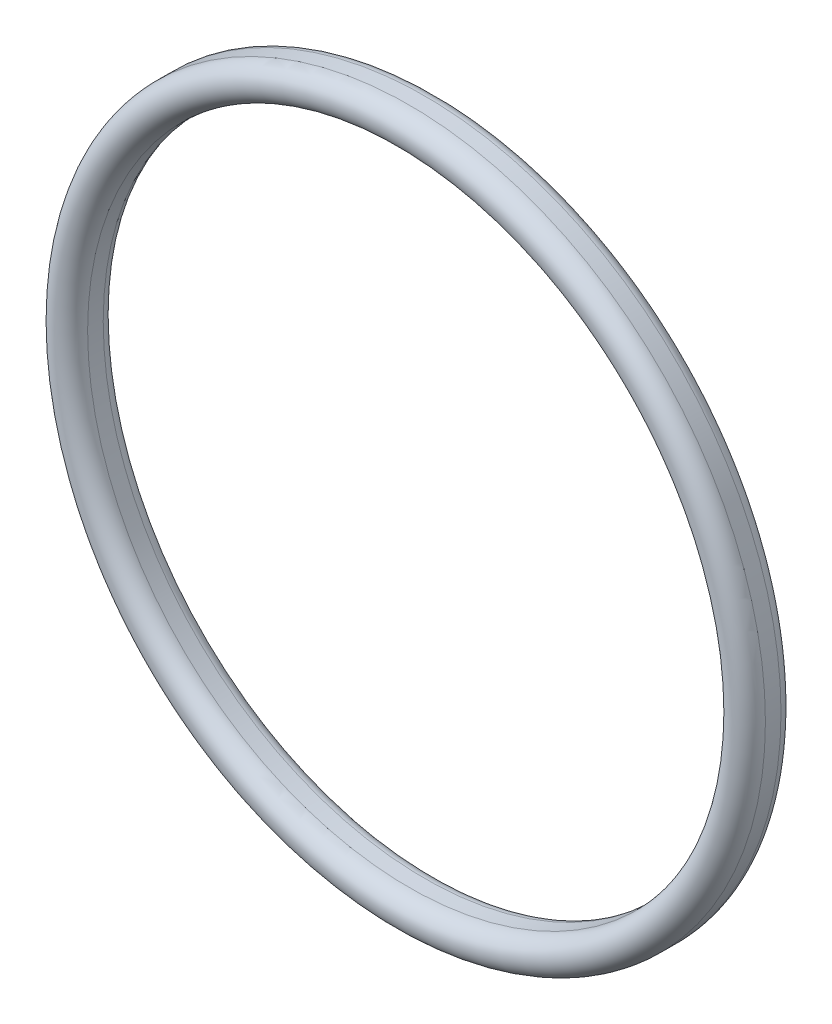
ISO-10303-21;
HEADER;
FILE_DESCRIPTION(('STEP AP214'),'2;1');
FILE_NAME('part.step','',(''),(''),'','','');
FILE_SCHEMA(('AUTOMOTIVE_DESIGN { 1 0 10303 214 1 1 1 1 }'));
ENDSEC;
DATA;
#1=APPLICATION_CONTEXT('core data for automotive mechanical design processes');
#2=APPLICATION_PROTOCOL_DEFINITION('international standard','automotive_design',2000,#1);
#3=PRODUCT_CONTEXT('',#1,'mechanical');
#4=PRODUCT('Part','Part','',(#3));
#5=PRODUCT_RELATED_PRODUCT_CATEGORY('part','',(#4));
#6=PRODUCT_DEFINITION_FORMATION('','',#4);
#7=PRODUCT_DEFINITION_CONTEXT('part definition',#1,'design');
#8=PRODUCT_DEFINITION('design','',#6,#7);
#9=PRODUCT_DEFINITION_SHAPE('','',#8);
#10=(LENGTH_UNIT() NAMED_UNIT(*) SI_UNIT(.MILLI.,.METRE.));
#11=(NAMED_UNIT(*) PLANE_ANGLE_UNIT() SI_UNIT($,.RADIAN.));
#12=(NAMED_UNIT(*) SI_UNIT($,.STERADIAN.) SOLID_ANGLE_UNIT());
#13=UNCERTAINTY_MEASURE_WITH_UNIT(LENGTH_MEASURE(1.E-05),#10,'distance_accuracy_value','');
#14=(GEOMETRIC_REPRESENTATION_CONTEXT(3) GLOBAL_UNCERTAINTY_ASSIGNED_CONTEXT((#13)) GLOBAL_UNIT_ASSIGNED_CONTEXT((#10,
#11,#12)) REPRESENTATION_CONTEXT('',''));
#15=CARTESIAN_POINT('',(0.,0.,0.));
#16=DIRECTION('',(0.,0.,1.));
#17=DIRECTION('',(1.,0.,0.));
#18=AXIS2_PLACEMENT_3D('',#15,#16,#17);
#19=CARTESIAN_POINT('',(0.,0.,2.314));
#20=DIRECTION('',(0.,0.,-1.));
#21=DIRECTION('',(-1.,0.,0.));
#22=AXIS2_PLACEMENT_3D('',#19,#20,#21);
#23=TOROIDAL_SURFACE('',#22,28.55,1.45);
#24=CARTESIAN_POINT('',(0.,0.,2.314));
#25=DIRECTION('',(0.,0.,-1.));
#26=DIRECTION('',(-1.,0.,0.));
#27=AXIS2_PLACEMENT_3D('',#24,#25,#26);
#28=CIRCLE('',#27,27.1);
#29=CARTESIAN_POINT('',(-27.1,0.,2.314));
#30=VERTEX_POINT('',#29);
#31=EDGE_CURVE('E10',#30,#30,#28,.T.);
#32=ORIENTED_EDGE('',*,*,#31,.T.);
#33=EDGE_LOOP('',(#32));
#34=FACE_BOUND('',#33,.T.);
#35=CARTESIAN_POINT('',(0.,0.,2.314));
#36=DIRECTION('',(0.,0.,-1.));
#37=DIRECTION('',(-1.,0.,0.));
#38=AXIS2_PLACEMENT_3D('',#35,#36,#37);
#39=CIRCLE('',#38,30.);
#40=CARTESIAN_POINT('',(-30.,0.,2.314));
#41=VERTEX_POINT('',#40);
#42=EDGE_CURVE('E52',#41,#41,#39,.T.);
#43=ORIENTED_EDGE('',*,*,#42,.F.);
#44=EDGE_LOOP('',(#43));
#45=FACE_BOUND('',#44,.T.);
#46=ADVANCED_FACE('F30',(#34,#45),#23,.T.);
#47=CARTESIAN_POINT('',(0.,0.,0.));
#48=DIRECTION('',(0.,0.,-1.));
#49=DIRECTION('',(-1.,0.,0.));
#50=AXIS2_PLACEMENT_3D('',#47,#48,#49);
#51=CYLINDRICAL_SURFACE('',#50,27.1);
#52=CARTESIAN_POINT('',(0.,0.,1.00000000000001));
#53=DIRECTION('',(0.,0.,-1.));
#54=DIRECTION('',(-1.,0.,0.));
#55=AXIS2_PLACEMENT_3D('',#52,#53,#54);
#56=CIRCLE('',#55,27.1);
#57=CARTESIAN_POINT('',(-27.1,0.,1.00000000000001));
#58=VERTEX_POINT('',#57);
#59=EDGE_CURVE('E36',#58,#58,#56,.T.);
#60=ORIENTED_EDGE('',*,*,#59,.T.);
#61=EDGE_LOOP('',(#60));
#62=FACE_BOUND('',#61,.T.);
#63=ORIENTED_EDGE('',*,*,#31,.F.);
#64=EDGE_LOOP('',(#63));
#65=FACE_BOUND('',#64,.T.);
#66=ADVANCED_FACE('F60',(#62,#65),#51,.F.);
#67=CARTESIAN_POINT('',(0.,0.,1.));
#68=DIRECTION('',(0.,0.,-1.));
#69=DIRECTION('',(-1.,0.,0.));
#70=AXIS2_PLACEMENT_3D('',#67,#68,#69);
#71=TOROIDAL_SURFACE('',#70,28.1,1.);
#72=CARTESIAN_POINT('',(0.,0.,0.));
#73=DIRECTION('',(0.,0.,-1.));
#74=DIRECTION('',(-1.,0.,0.));
#75=AXIS2_PLACEMENT_3D('',#72,#73,#74);
#76=CIRCLE('',#75,28.1);
#77=CARTESIAN_POINT('',(-28.1,0.,0.));
#78=VERTEX_POINT('',#77);
#79=EDGE_CURVE('E40',#78,#78,#76,.T.);
#80=ORIENTED_EDGE('',*,*,#79,.T.);
#81=EDGE_LOOP('',(#80));
#82=FACE_BOUND('',#81,.T.);
#83=ORIENTED_EDGE('',*,*,#59,.F.);
#84=EDGE_LOOP('',(#83));
#85=FACE_BOUND('',#84,.T.);
#86=ADVANCED_FACE('F64',(#82,#85),#71,.T.);
#87=CARTESIAN_POINT('',(0.,28.1,0.));
#88=DIRECTION('',(0.,0.,-1.));
#89=DIRECTION('',(-1.,0.,0.));
#90=AXIS2_PLACEMENT_3D('',#87,#88,#89);
#91=PLANE('',#90);
#92=CARTESIAN_POINT('',(0.,0.,0.));
#93=DIRECTION('',(0.,0.,-1.));
#94=DIRECTION('',(-1.,0.,0.));
#95=AXIS2_PLACEMENT_3D('',#92,#93,#94);
#96=CIRCLE('',#95,29.);
#97=CARTESIAN_POINT('',(-29.,0.,0.));
#98=VERTEX_POINT('',#97);
#99=EDGE_CURVE('E44',#98,#98,#96,.T.);
#100=ORIENTED_EDGE('',*,*,#99,.T.);
#101=EDGE_LOOP('',(#100));
#102=FACE_BOUND('',#101,.T.);
#103=ORIENTED_EDGE('',*,*,#79,.F.);
#104=EDGE_LOOP('',(#103));
#105=FACE_BOUND('',#104,.T.);
#106=ADVANCED_FACE('F68',(#102,#105),#91,.T.);
#107=CARTESIAN_POINT('',(0.,0.,1.));
#108=DIRECTION('',(0.,0.,-1.));
#109=DIRECTION('',(-1.,0.,0.));
#110=AXIS2_PLACEMENT_3D('',#107,#108,#109);
#111=TOROIDAL_SURFACE('',#110,29.,1.);
#112=CARTESIAN_POINT('',(0.,0.,1.00000000000001));
#113=DIRECTION('',(0.,0.,-1.));
#114=DIRECTION('',(-1.,0.,0.));
#115=AXIS2_PLACEMENT_3D('',#112,#113,#114);
#116=CIRCLE('',#115,30.);
#117=CARTESIAN_POINT('',(-30.,0.,1.00000000000001));
#118=VERTEX_POINT('',#117);
#119=EDGE_CURVE('E49',#118,#118,#116,.T.);
#120=ORIENTED_EDGE('',*,*,#119,.T.);
#121=EDGE_LOOP('',(#120));
#122=FACE_BOUND('',#121,.T.);
#123=ORIENTED_EDGE('',*,*,#99,.F.);
#124=EDGE_LOOP('',(#123));
#125=FACE_BOUND('',#124,.T.);
#126=ADVANCED_FACE('F75',(#122,#125),#111,.T.);
#127=CARTESIAN_POINT('',(0.,0.,0.));
#128=DIRECTION('',(0.,0.,-1.));
#129=DIRECTION('',(-1.,0.,0.));
#130=AXIS2_PLACEMENT_3D('',#127,#128,#129);
#131=CYLINDRICAL_SURFACE('',#130,30.);
#132=ORIENTED_EDGE('',*,*,#42,.T.);
#133=EDGE_LOOP('',(#132));
#134=FACE_BOUND('',#133,.T.);
#135=ORIENTED_EDGE('',*,*,#119,.F.);
#136=EDGE_LOOP('',(#135));
#137=FACE_BOUND('',#136,.T.);
#138=ADVANCED_FACE('F56',(#134,#137),#131,.T.);
#139=CLOSED_SHELL('',(#46,#66,#86,#106,#126,#138));
#140=MANIFOLD_SOLID_BREP('B2',#139);
#141=ADVANCED_BREP_SHAPE_REPRESENTATION('',(#18,#140),#14);
#142=SHAPE_DEFINITION_REPRESENTATION(#9,#141);
ENDSEC;
END-ISO-10303-21;
